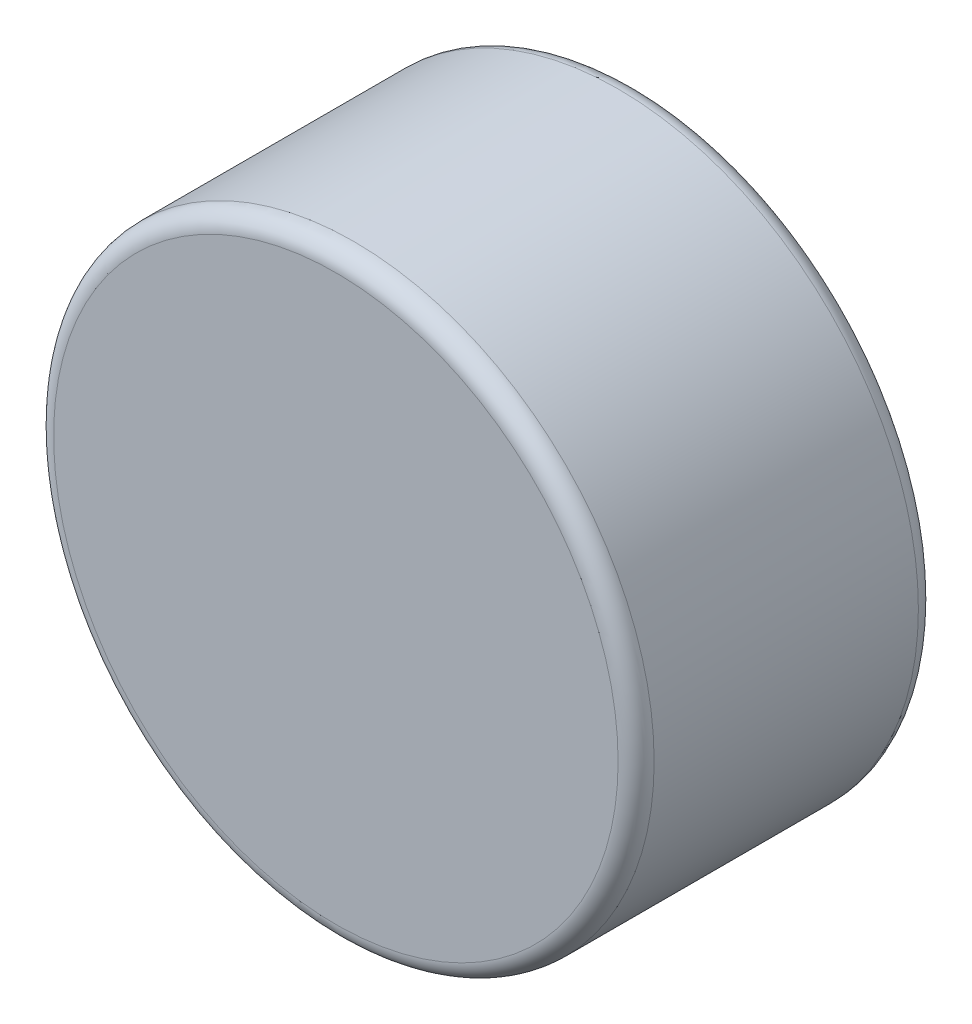
ISO-10303-21;
HEADER;
FILE_DESCRIPTION(('STEP AP214'),'2;1');
FILE_NAME('part.step','',(''),(''),'','','');
FILE_SCHEMA(('AUTOMOTIVE_DESIGN { 1 0 10303 214 1 1 1 1 }'));
ENDSEC;
DATA;
#1=APPLICATION_CONTEXT('core data for automotive mechanical design processes');
#2=APPLICATION_PROTOCOL_DEFINITION('international standard','automotive_design',2000,#1);
#3=PRODUCT_CONTEXT('',#1,'mechanical');
#4=PRODUCT('Part','Part','',(#3));
#5=PRODUCT_RELATED_PRODUCT_CATEGORY('part','',(#4));
#6=PRODUCT_DEFINITION_FORMATION('','',#4);
#7=PRODUCT_DEFINITION_CONTEXT('part definition',#1,'design');
#8=PRODUCT_DEFINITION('design','',#6,#7);
#9=PRODUCT_DEFINITION_SHAPE('','',#8);
#10=(LENGTH_UNIT() NAMED_UNIT(*) SI_UNIT(.MILLI.,.METRE.));
#11=(NAMED_UNIT(*) PLANE_ANGLE_UNIT() SI_UNIT($,.RADIAN.));
#12=(NAMED_UNIT(*) SI_UNIT($,.STERADIAN.) SOLID_ANGLE_UNIT());
#13=UNCERTAINTY_MEASURE_WITH_UNIT(LENGTH_MEASURE(1.E-05),#10,'distance_accuracy_value','');
#14=(GEOMETRIC_REPRESENTATION_CONTEXT(3) GLOBAL_UNCERTAINTY_ASSIGNED_CONTEXT((#13)) GLOBAL_UNIT_ASSIGNED_CONTEXT((#10,
#11,#12)) REPRESENTATION_CONTEXT('',''));
#15=CARTESIAN_POINT('',(0.,0.,0.));
#16=DIRECTION('',(0.,0.,1.));
#17=DIRECTION('',(1.,0.,0.));
#18=AXIS2_PLACEMENT_3D('',#15,#16,#17);
#19=CARTESIAN_POINT('',(0.,0.,5.));
#20=DIRECTION('',(0.,0.,-1.));
#21=DIRECTION('',(-1.,0.,0.));
#22=AXIS2_PLACEMENT_3D('',#19,#20,#21);
#23=CYLINDRICAL_SURFACE('',#22,5.);
#24=CARTESIAN_POINT('',(0.,0.,0.3));
#25=DIRECTION('',(0.,0.,1.));
#26=DIRECTION('',(1.,0.,0.));
#27=AXIS2_PLACEMENT_3D('',#24,#25,#26);
#28=CIRCLE('',#27,5.);
#29=CARTESIAN_POINT('',(5.,0.,0.3));
#30=VERTEX_POINT('',#29);
#31=EDGE_CURVE('E42',#30,#30,#28,.T.);
#32=ORIENTED_EDGE('',*,*,#31,.T.);
#33=EDGE_LOOP('',(#32));
#34=FACE_BOUND('',#33,.T.);
#35=CARTESIAN_POINT('',(0.,0.,4.7));
#36=DIRECTION('',(0.,0.,1.));
#37=DIRECTION('',(1.,0.,0.));
#38=AXIS2_PLACEMENT_3D('',#35,#36,#37);
#39=CIRCLE('',#38,5.);
#40=CARTESIAN_POINT('',(5.,0.,4.7));
#41=VERTEX_POINT('',#40);
#42=EDGE_CURVE('E46',#41,#41,#39,.F.);
#43=ORIENTED_EDGE('',*,*,#42,.T.);
#44=EDGE_LOOP('',(#43));
#45=FACE_BOUND('',#44,.T.);
#46=ADVANCED_FACE('F31',(#34,#45),#23,.T.);
#47=CARTESIAN_POINT('',(0.,0.,5.));
#48=DIRECTION('',(0.,0.,1.));
#49=DIRECTION('',(1.,0.,0.));
#50=AXIS2_PLACEMENT_3D('',#47,#48,#49);
#51=PLANE('',#50);
#52=CARTESIAN_POINT('',(0.,0.,5.));
#53=DIRECTION('',(0.,0.,1.));
#54=DIRECTION('',(1.,0.,0.));
#55=AXIS2_PLACEMENT_3D('',#52,#53,#54);
#56=CIRCLE('',#55,4.7);
#57=CARTESIAN_POINT('',(4.7,0.,5.));
#58=VERTEX_POINT('',#57);
#59=EDGE_CURVE('E10',#58,#58,#56,.T.);
#60=ORIENTED_EDGE('',*,*,#59,.T.);
#61=EDGE_LOOP('',(#60));
#62=FACE_BOUND('',#61,.T.);
#63=ADVANCED_FACE('F62',(#62),#51,.T.);
#64=CARTESIAN_POINT('',(0.,0.,0.));
#65=DIRECTION('',(0.,0.,1.));
#66=DIRECTION('',(1.,0.,0.));
#67=AXIS2_PLACEMENT_3D('',#64,#65,#66);
#68=PLANE('',#67);
#69=CARTESIAN_POINT('',(0.,0.,0.));
#70=DIRECTION('',(0.,0.,1.));
#71=DIRECTION('',(1.,0.,0.));
#72=AXIS2_PLACEMENT_3D('',#69,#70,#71);
#73=CIRCLE('',#72,4.7);
#74=CARTESIAN_POINT('',(4.7,0.,0.));
#75=VERTEX_POINT('',#74);
#76=EDGE_CURVE('E38',#75,#75,#73,.F.);
#77=ORIENTED_EDGE('',*,*,#76,.T.);
#78=EDGE_LOOP('',(#77));
#79=FACE_BOUND('',#78,.T.);
#80=ADVANCED_FACE('F59',(#79),#68,.F.);
#81=CARTESIAN_POINT('',(0.,0.,0.3));
#82=DIRECTION('',(0.,0.,1.));
#83=DIRECTION('',(1.,0.,0.));
#84=AXIS2_PLACEMENT_3D('',#81,#82,#83);
#85=TOROIDAL_SURFACE('',#84,4.7,0.3);
#86=ORIENTED_EDGE('',*,*,#76,.F.);
#87=EDGE_LOOP('',(#86));
#88=FACE_BOUND('',#87,.T.);
#89=ORIENTED_EDGE('',*,*,#31,.F.);
#90=EDGE_LOOP('',(#89));
#91=FACE_BOUND('',#90,.T.);
#92=ADVANCED_FACE('F55',(#88,#91),#85,.T.);
#93=CARTESIAN_POINT('',(0.,0.,4.7));
#94=DIRECTION('',(0.,0.,1.));
#95=DIRECTION('',(1.,0.,0.));
#96=AXIS2_PLACEMENT_3D('',#93,#94,#95);
#97=TOROIDAL_SURFACE('',#96,4.7,0.3);
#98=ORIENTED_EDGE('',*,*,#42,.F.);
#99=EDGE_LOOP('',(#98));
#100=FACE_BOUND('',#99,.T.);
#101=ORIENTED_EDGE('',*,*,#59,.F.);
#102=EDGE_LOOP('',(#101));
#103=FACE_BOUND('',#102,.T.);
#104=ADVANCED_FACE('F33',(#100,#103),#97,.T.);
#105=CLOSED_SHELL('',(#46,#63,#80,#92,#104));
#106=MANIFOLD_SOLID_BREP('B2',#105);
#107=ADVANCED_BREP_SHAPE_REPRESENTATION('',(#18,#106),#14);
#108=SHAPE_DEFINITION_REPRESENTATION(#9,#107);
ENDSEC;
END-ISO-10303-21;
